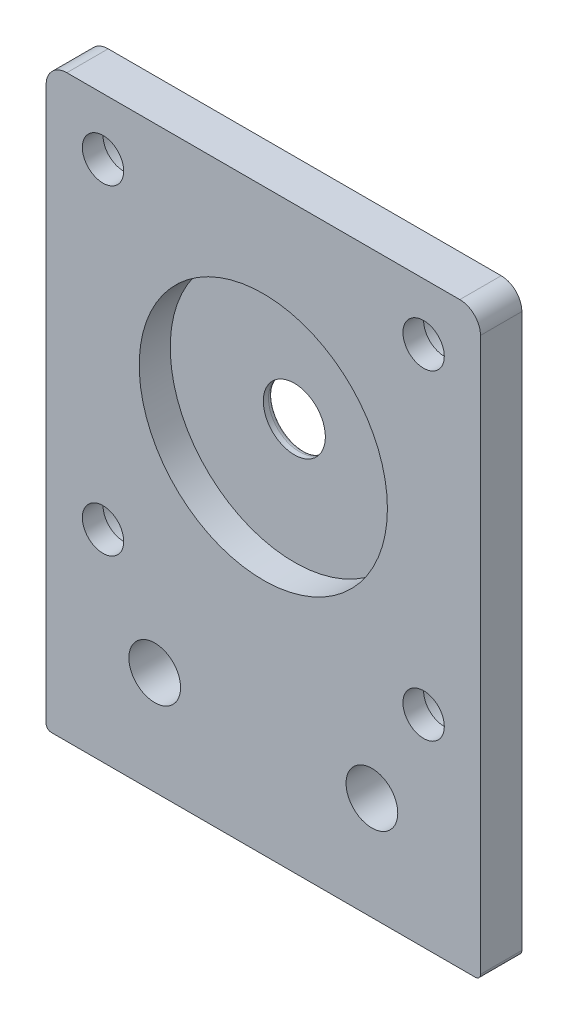
ISO-10303-21;
HEADER;
FILE_DESCRIPTION(('STEP AP214'),'2;1');
FILE_NAME('part.step','',(''),(''),'','','');
FILE_SCHEMA(('AUTOMOTIVE_DESIGN { 1 0 10303 214 1 1 1 1 }'));
ENDSEC;
DATA;
#1=APPLICATION_CONTEXT('core data for automotive mechanical design processes');
#2=APPLICATION_PROTOCOL_DEFINITION('international standard','automotive_design',2000,#1);
#3=PRODUCT_CONTEXT('',#1,'mechanical');
#4=PRODUCT('Part','Part','',(#3));
#5=PRODUCT_RELATED_PRODUCT_CATEGORY('part','',(#4));
#6=PRODUCT_DEFINITION_FORMATION('','',#4);
#7=PRODUCT_DEFINITION_CONTEXT('part definition',#1,'design');
#8=PRODUCT_DEFINITION('design','',#6,#7);
#9=PRODUCT_DEFINITION_SHAPE('','',#8);
#10=(LENGTH_UNIT() NAMED_UNIT(*) SI_UNIT(.MILLI.,.METRE.));
#11=(NAMED_UNIT(*) PLANE_ANGLE_UNIT() SI_UNIT($,.RADIAN.));
#12=(NAMED_UNIT(*) SI_UNIT($,.STERADIAN.) SOLID_ANGLE_UNIT());
#13=UNCERTAINTY_MEASURE_WITH_UNIT(LENGTH_MEASURE(1.E-05),#10,'distance_accuracy_value','');
#14=(GEOMETRIC_REPRESENTATION_CONTEXT(3) GLOBAL_UNCERTAINTY_ASSIGNED_CONTEXT((#13)) GLOBAL_UNIT_ASSIGNED_CONTEXT((#10,
#11,#12)) REPRESENTATION_CONTEXT('',''));
#15=CARTESIAN_POINT('',(0.,0.,0.));
#16=DIRECTION('',(0.,0.,1.));
#17=DIRECTION('',(1.,0.,0.));
#18=AXIS2_PLACEMENT_3D('',#15,#16,#17);
#19=CARTESIAN_POINT('',(5.49999999999594,50.4999999999987,-6.));
#20=DIRECTION('',(0.,0.,1.));
#21=DIRECTION('',(1.,0.,0.));
#22=AXIS2_PLACEMENT_3D('',#19,#20,#21);
#23=CYLINDRICAL_SURFACE('',#22,2.);
#24=CARTESIAN_POINT('',(5.49999999999594,50.4999999999987,4.));
#25=DIRECTION('',(0.,0.,1.));
#26=DIRECTION('',(1.,0.,0.));
#27=AXIS2_PLACEMENT_3D('',#24,#25,#26);
#28=CIRCLE('',#27,2.);
#29=CARTESIAN_POINT('',(7.49999999999594,50.4999999999987,4.));
#30=VERTEX_POINT('',#29);
#31=EDGE_CURVE('E240',#30,#30,#28,.T.);
#32=ORIENTED_EDGE('',*,*,#31,.T.);
#33=EDGE_LOOP('',(#32));
#34=FACE_BOUND('',#33,.T.);
#35=CARTESIAN_POINT('',(5.49999999999594,50.4999999999987,2.));
#36=DIRECTION('',(0.,0.,-1.));
#37=DIRECTION('',(-1.,0.,0.));
#38=AXIS2_PLACEMENT_3D('',#35,#36,#37);
#39=CIRCLE('',#38,2.);
#40=CARTESIAN_POINT('',(3.49999999999594,50.4999999999987,2.));
#41=VERTEX_POINT('',#40);
#42=EDGE_CURVE('E44',#41,#41,#39,.F.);
#43=ORIENTED_EDGE('',*,*,#42,.F.);
#44=EDGE_LOOP('',(#43));
#45=FACE_BOUND('',#44,.T.);
#46=ADVANCED_FACE('F40',(#34,#45),#23,.F.);
#47=CARTESIAN_POINT('',(5.49999999999595,19.4999999999987,-6.));
#48=DIRECTION('',(0.,0.,1.));
#49=DIRECTION('',(1.,0.,0.));
#50=AXIS2_PLACEMENT_3D('',#47,#48,#49);
#51=CYLINDRICAL_SURFACE('',#50,2.);
#52=CARTESIAN_POINT('',(5.49999999999595,19.4999999999987,4.));
#53=DIRECTION('',(0.,0.,1.));
#54=DIRECTION('',(1.,0.,0.));
#55=AXIS2_PLACEMENT_3D('',#52,#53,#54);
#56=CIRCLE('',#55,2.);
#57=CARTESIAN_POINT('',(7.49999999999595,19.4999999999987,4.));
#58=VERTEX_POINT('',#57);
#59=EDGE_CURVE('E236',#58,#58,#56,.T.);
#60=ORIENTED_EDGE('',*,*,#59,.T.);
#61=EDGE_LOOP('',(#60));
#62=FACE_BOUND('',#61,.T.);
#63=CARTESIAN_POINT('',(5.49999999999595,19.4999999999987,2.));
#64=DIRECTION('',(0.,0.,-1.));
#65=DIRECTION('',(-1.,0.,0.));
#66=AXIS2_PLACEMENT_3D('',#63,#64,#65);
#67=CIRCLE('',#66,2.);
#68=CARTESIAN_POINT('',(3.49999999999594,19.4999999999987,2.));
#69=VERTEX_POINT('',#68);
#70=EDGE_CURVE('E218',#69,#69,#67,.F.);
#71=ORIENTED_EDGE('',*,*,#70,.F.);
#72=EDGE_LOOP('',(#71));
#73=FACE_BOUND('',#72,.T.);
#74=ADVANCED_FACE('F295',(#62,#73),#51,.F.);
#75=CARTESIAN_POINT('',(36.4999999999959,19.4999999999987,-6.));
#76=DIRECTION('',(0.,0.,1.));
#77=DIRECTION('',(1.,0.,0.));
#78=AXIS2_PLACEMENT_3D('',#75,#76,#77);
#79=CYLINDRICAL_SURFACE('',#78,2.);
#80=CARTESIAN_POINT('',(36.4999999999959,19.4999999999987,4.));
#81=DIRECTION('',(0.,0.,1.));
#82=DIRECTION('',(1.,0.,0.));
#83=AXIS2_PLACEMENT_3D('',#80,#81,#82);
#84=CIRCLE('',#83,2.);
#85=CARTESIAN_POINT('',(38.4999999999959,19.4999999999987,4.));
#86=VERTEX_POINT('',#85);
#87=EDGE_CURVE('E230',#86,#86,#84,.T.);
#88=ORIENTED_EDGE('',*,*,#87,.T.);
#89=EDGE_LOOP('',(#88));
#90=FACE_BOUND('',#89,.T.);
#91=CARTESIAN_POINT('',(36.4999999999959,19.4999999999987,2.));
#92=DIRECTION('',(0.,0.,-1.));
#93=DIRECTION('',(-1.,0.,0.));
#94=AXIS2_PLACEMENT_3D('',#91,#92,#93);
#95=CIRCLE('',#94,2.);
#96=CARTESIAN_POINT('',(34.4999999999959,19.4999999999987,2.));
#97=VERTEX_POINT('',#96);
#98=EDGE_CURVE('E214',#97,#97,#95,.F.);
#99=ORIENTED_EDGE('',*,*,#98,.F.);
#100=EDGE_LOOP('',(#99));
#101=FACE_BOUND('',#100,.T.);
#102=ADVANCED_FACE('F302',(#90,#101),#79,.F.);
#103=CARTESIAN_POINT('',(36.4999999999959,50.4999999999987,-6.));
#104=DIRECTION('',(0.,0.,1.));
#105=DIRECTION('',(1.,0.,0.));
#106=AXIS2_PLACEMENT_3D('',#103,#104,#105);
#107=CYLINDRICAL_SURFACE('',#106,2.);
#108=CARTESIAN_POINT('',(36.4999999999959,50.4999999999987,4.));
#109=DIRECTION('',(0.,0.,1.));
#110=DIRECTION('',(1.,0.,0.));
#111=AXIS2_PLACEMENT_3D('',#108,#109,#110);
#112=CIRCLE('',#111,2.);
#113=CARTESIAN_POINT('',(38.4999999999959,50.4999999999987,4.));
#114=VERTEX_POINT('',#113);
#115=EDGE_CURVE('E225',#114,#114,#112,.T.);
#116=ORIENTED_EDGE('',*,*,#115,.T.);
#117=EDGE_LOOP('',(#116));
#118=FACE_BOUND('',#117,.T.);
#119=CARTESIAN_POINT('',(36.4999999999959,50.4999999999987,2.));
#120=DIRECTION('',(0.,0.,-1.));
#121=DIRECTION('',(-1.,0.,0.));
#122=AXIS2_PLACEMENT_3D('',#119,#120,#121);
#123=CIRCLE('',#122,2.);
#124=CARTESIAN_POINT('',(34.4999999999959,50.4999999999987,2.));
#125=VERTEX_POINT('',#124);
#126=EDGE_CURVE('E210',#125,#125,#123,.F.);
#127=ORIENTED_EDGE('',*,*,#126,.F.);
#128=EDGE_LOOP('',(#127));
#129=FACE_BOUND('',#128,.T.);
#130=ADVANCED_FACE('F308',(#118,#129),#107,.F.);
#131=CARTESIAN_POINT('',(20.9999999999959,34.9999999999987,4.));
#132=DIRECTION('',(0.,0.,-1.));
#133=DIRECTION('',(-1.,0.,0.));
#134=AXIS2_PLACEMENT_3D('',#131,#132,#133);
#135=CYLINDRICAL_SURFACE('',#134,2.99999999937829);
#136=CARTESIAN_POINT('',(20.9999999999959,34.9999999999987,0.5));
#137=DIRECTION('',(0.,0.,1.));
#138=DIRECTION('',(1.,0.,0.));
#139=AXIS2_PLACEMENT_3D('',#136,#137,#138);
#140=CIRCLE('',#139,2.99999999937829);
#141=CARTESIAN_POINT('',(23.9999999993742,34.9999999999987,0.5));
#142=VERTEX_POINT('',#141);
#143=EDGE_CURVE('E11',#142,#142,#140,.F.);
#144=ORIENTED_EDGE('',*,*,#143,.T.);
#145=EDGE_LOOP('',(#144));
#146=FACE_BOUND('',#145,.T.);
#147=CARTESIAN_POINT('',(20.9999999999959,34.9999999999987,1.));
#148=DIRECTION('',(0.,0.,1.));
#149=DIRECTION('',(1.,0.,0.));
#150=AXIS2_PLACEMENT_3D('',#147,#148,#149);
#151=CIRCLE('',#150,2.99999999937829);
#152=CARTESIAN_POINT('',(23.9999999993742,34.9999999999987,1.));
#153=VERTEX_POINT('',#152);
#154=EDGE_CURVE('E151',#153,#153,#151,.T.);
#155=ORIENTED_EDGE('',*,*,#154,.T.);
#156=EDGE_LOOP('',(#155));
#157=FACE_BOUND('',#156,.T.);
#158=ADVANCED_FACE('F326',(#146,#157),#135,.F.);
#159=CARTESIAN_POINT('',(0.,0.,4.));
#160=DIRECTION('',(0.,0.,1.));
#161=DIRECTION('',(1.,0.,0.));
#162=AXIS2_PLACEMENT_3D('',#159,#160,#161);
#163=PLANE('',#162);
#164=ORIENTED_EDGE('',*,*,#115,.F.);
#165=EDGE_LOOP('',(#164));
#166=FACE_BOUND('',#165,.T.);
#167=ORIENTED_EDGE('',*,*,#87,.F.);
#168=EDGE_LOOP('',(#167));
#169=FACE_BOUND('',#168,.T.);
#170=ORIENTED_EDGE('',*,*,#59,.F.);
#171=EDGE_LOOP('',(#170));
#172=FACE_BOUND('',#171,.T.);
#173=ORIENTED_EDGE('',*,*,#31,.F.);
#174=EDGE_LOOP('',(#173));
#175=FACE_BOUND('',#174,.T.);
#176=CARTESIAN_POINT('',(10.5000000000015,10.,4.));
#177=DIRECTION('',(0.,0.,1.));
#178=DIRECTION('',(1.,0.,0.));
#179=AXIS2_PLACEMENT_3D('',#176,#177,#178);
#180=CIRCLE('',#179,2.5);
#181=CARTESIAN_POINT('',(13.0000000000015,10.,4.));
#182=VERTEX_POINT('',#181);
#183=EDGE_CURVE('E205',#182,#182,#180,.T.);
#184=ORIENTED_EDGE('',*,*,#183,.F.);
#185=EDGE_LOOP('',(#184));
#186=FACE_BOUND('',#185,.T.);
#187=CARTESIAN_POINT('',(31.5000000000016,10.,4.));
#188=DIRECTION('',(0.,0.,1.));
#189=DIRECTION('',(1.,0.,0.));
#190=AXIS2_PLACEMENT_3D('',#187,#188,#189);
#191=CIRCLE('',#190,2.5);
#192=CARTESIAN_POINT('',(34.0000000000016,10.,4.));
#193=VERTEX_POINT('',#192);
#194=EDGE_CURVE('E244',#193,#193,#191,.T.);
#195=ORIENTED_EDGE('',*,*,#194,.F.);
#196=EDGE_LOOP('',(#195));
#197=FACE_BOUND('',#196,.T.);
#198=CARTESIAN_POINT('',(20.9999999999959,34.9999999999987,4.));
#199=DIRECTION('',(0.,0.,1.));
#200=DIRECTION('',(1.,0.,0.));
#201=AXIS2_PLACEMENT_3D('',#198,#199,#200);
#202=CIRCLE('',#201,12.);
#203=CARTESIAN_POINT('',(32.9999999999959,34.9999999999987,4.));
#204=VERTEX_POINT('',#203);
#205=EDGE_CURVE('E209',#204,#204,#202,.T.);
#206=ORIENTED_EDGE('',*,*,#205,.F.);
#207=EDGE_LOOP('',(#206));
#208=FACE_BOUND('',#207,.T.);
#209=DIRECTION('',(1.,0.,0.));
#210=VECTOR('',#209,1.);
#211=CARTESIAN_POINT('',(0.,0.,4.));
#212=LINE('',#211,#210);
#213=CARTESIAN_POINT('',(0.500000000000019,0.,4.));
#214=VERTEX_POINT('',#213);
#215=CARTESIAN_POINT('',(41.5000000000021,0.,4.));
#216=VERTEX_POINT('',#215);
#217=EDGE_CURVE('E145',#214,#216,#212,.T.);
#218=ORIENTED_EDGE('',*,*,#217,.T.);
#219=CARTESIAN_POINT('',(41.5000000000021,0.5,4.));
#220=DIRECTION('',(0.,0.,1.));
#221=DIRECTION('',(1.,0.,0.));
#222=AXIS2_PLACEMENT_3D('',#219,#220,#221);
#223=CIRCLE('',#222,0.5);
#224=CARTESIAN_POINT('',(42.0000000000021,0.5,4.));
#225=VERTEX_POINT('',#224);
#226=EDGE_CURVE('E192',#216,#225,#223,.T.);
#227=ORIENTED_EDGE('',*,*,#226,.T.);
#228=DIRECTION('',(0.,1.,0.));
#229=VECTOR('',#228,1.);
#230=CARTESIAN_POINT('',(42.0000000000021,0.,4.));
#231=LINE('',#230,#229);
#232=CARTESIAN_POINT('',(42.0000000000021,54.0000000000021,4.));
#233=VERTEX_POINT('',#232);
#234=EDGE_CURVE('E259',#225,#233,#231,.T.);
#235=ORIENTED_EDGE('',*,*,#234,.T.);
#236=CARTESIAN_POINT('',(40.0000000000021,54.0000000000021,4.));
#237=DIRECTION('',(0.,0.,1.));
#238=DIRECTION('',(1.,0.,0.));
#239=AXIS2_PLACEMENT_3D('',#236,#237,#238);
#240=CIRCLE('',#239,2.);
#241=CARTESIAN_POINT('',(40.0000000000021,56.0000000000021,4.));
#242=VERTEX_POINT('',#241);
#243=EDGE_CURVE('E166',#233,#242,#240,.T.);
#244=ORIENTED_EDGE('',*,*,#243,.T.);
#245=DIRECTION('',(-1.,0.,0.));
#246=VECTOR('',#245,1.);
#247=CARTESIAN_POINT('',(37.3715728752559,56.0000000000021,4.));
#248=LINE('',#247,#246);
#249=CARTESIAN_POINT('',(2.00000000000201,56.0000000000021,4.));
#250=VERTEX_POINT('',#249);
#251=EDGE_CURVE('E133',#242,#250,#248,.T.);
#252=ORIENTED_EDGE('',*,*,#251,.T.);
#253=CARTESIAN_POINT('',(2.00000000000201,54.0000000000021,4.));
#254=DIRECTION('',(0.,0.,1.));
#255=DIRECTION('',(1.,0.,0.));
#256=AXIS2_PLACEMENT_3D('',#253,#254,#255);
#257=CIRCLE('',#256,2.);
#258=CARTESIAN_POINT('',(2.0073228793446E-12,54.0000000000022,4.));
#259=VERTEX_POINT('',#258);
#260=EDGE_CURVE('E163',#250,#259,#257,.T.);
#261=ORIENTED_EDGE('',*,*,#260,.T.);
#262=DIRECTION('',(0.,-1.,0.));
#263=VECTOR('',#262,1.);
#264=CARTESIAN_POINT('',(0.,0.,4.));
#265=LINE('',#264,#263);
#266=CARTESIAN_POINT('',(0.,0.500000000000018,4.));
#267=VERTEX_POINT('',#266);
#268=EDGE_CURVE('E140',#259,#267,#265,.T.);
#269=ORIENTED_EDGE('',*,*,#268,.T.);
#270=CARTESIAN_POINT('',(0.500000000000019,0.5,4.));
#271=DIRECTION('',(0.,0.,1.));
#272=DIRECTION('',(1.,0.,0.));
#273=AXIS2_PLACEMENT_3D('',#270,#271,#272);
#274=CIRCLE('',#273,0.5);
#275=EDGE_CURVE('E189',#267,#214,#274,.T.);
#276=ORIENTED_EDGE('',*,*,#275,.T.);
#277=EDGE_LOOP('',(#218,#227,#235,#244,#252,#261,#269,#276));
#278=FACE_BOUND('',#277,.T.);
#279=ADVANCED_FACE('F275',(#166,#169,#172,#175,#186,#197,#208,#278),#163,.T.);
#280=CARTESIAN_POINT('',(0.,0.,0.));
#281=DIRECTION('',(0.,0.,1.));
#282=DIRECTION('',(1.,0.,0.));
#283=AXIS2_PLACEMENT_3D('',#280,#281,#282);
#284=PLANE('',#283);
#285=CARTESIAN_POINT('',(5.49999999999594,50.4999999999987,0.));
#286=DIRECTION('',(0.,0.,-1.));
#287=DIRECTION('',(-1.,0.,0.));
#288=AXIS2_PLACEMENT_3D('',#285,#286,#287);
#289=CIRCLE('',#288,3.5);
#290=CARTESIAN_POINT('',(1.99999999999594,50.4999999999987,0.));
#291=VERTEX_POINT('',#290);
#292=EDGE_CURVE('E575',#291,#291,#289,.T.);
#293=ORIENTED_EDGE('',*,*,#292,.F.);
#294=EDGE_LOOP('',(#293));
#295=FACE_BOUND('',#294,.T.);
#296=CARTESIAN_POINT('',(5.49999999999595,19.4999999999987,0.));
#297=DIRECTION('',(0.,0.,-1.));
#298=DIRECTION('',(-1.,0.,0.));
#299=AXIS2_PLACEMENT_3D('',#296,#297,#298);
#300=CIRCLE('',#299,3.5);
#301=CARTESIAN_POINT('',(1.99999999999595,19.4999999999987,0.));
#302=VERTEX_POINT('',#301);
#303=EDGE_CURVE('E583',#302,#302,#300,.T.);
#304=ORIENTED_EDGE('',*,*,#303,.F.);
#305=EDGE_LOOP('',(#304));
#306=FACE_BOUND('',#305,.T.);
#307=CARTESIAN_POINT('',(36.4999999999959,19.4999999999987,0.));
#308=DIRECTION('',(0.,0.,-1.));
#309=DIRECTION('',(-1.,0.,0.));
#310=AXIS2_PLACEMENT_3D('',#307,#308,#309);
#311=CIRCLE('',#310,3.5);
#312=CARTESIAN_POINT('',(32.9999999999959,19.4999999999987,0.));
#313=VERTEX_POINT('',#312);
#314=EDGE_CURVE('E591',#313,#313,#311,.T.);
#315=ORIENTED_EDGE('',*,*,#314,.F.);
#316=EDGE_LOOP('',(#315));
#317=FACE_BOUND('',#316,.T.);
#318=CARTESIAN_POINT('',(36.4999999999959,50.4999999999987,0.));
#319=DIRECTION('',(0.,0.,-1.));
#320=DIRECTION('',(-1.,0.,0.));
#321=AXIS2_PLACEMENT_3D('',#318,#319,#320);
#322=CIRCLE('',#321,3.5);
#323=CARTESIAN_POINT('',(32.9999999999959,50.4999999999987,0.));
#324=VERTEX_POINT('',#323);
#325=EDGE_CURVE('E567',#324,#324,#322,.T.);
#326=ORIENTED_EDGE('',*,*,#325,.F.);
#327=EDGE_LOOP('',(#326));
#328=FACE_BOUND('',#327,.T.);
#329=CARTESIAN_POINT('',(10.5000000000015,10.,0.));
#330=DIRECTION('',(0.,0.,1.));
#331=DIRECTION('',(1.,0.,0.));
#332=AXIS2_PLACEMENT_3D('',#329,#330,#331);
#333=CIRCLE('',#332,2.5);
#334=CARTESIAN_POINT('',(13.0000000000015,10.,0.));
#335=VERTEX_POINT('',#334);
#336=EDGE_CURVE('E204',#335,#335,#333,.T.);
#337=ORIENTED_EDGE('',*,*,#336,.T.);
#338=EDGE_LOOP('',(#337));
#339=FACE_BOUND('',#338,.T.);
#340=CARTESIAN_POINT('',(31.5000000000016,10.,0.));
#341=DIRECTION('',(0.,0.,1.));
#342=DIRECTION('',(1.,0.,0.));
#343=AXIS2_PLACEMENT_3D('',#340,#341,#342);
#344=CIRCLE('',#343,2.5);
#345=CARTESIAN_POINT('',(34.0000000000016,10.,0.));
#346=VERTEX_POINT('',#345);
#347=EDGE_CURVE('E200',#346,#346,#344,.T.);
#348=ORIENTED_EDGE('',*,*,#347,.T.);
#349=EDGE_LOOP('',(#348));
#350=FACE_BOUND('',#349,.T.);
#351=CARTESIAN_POINT('',(20.9999999999959,34.9999999999987,0.));
#352=DIRECTION('',(0.,0.,1.));
#353=DIRECTION('',(1.,0.,0.));
#354=AXIS2_PLACEMENT_3D('',#351,#352,#353);
#355=CIRCLE('',#354,3.49999999937829);
#356=CARTESIAN_POINT('',(24.4999999993742,34.9999999999987,0.));
#357=VERTEX_POINT('',#356);
#358=EDGE_CURVE('E50',#357,#357,#355,.T.);
#359=ORIENTED_EDGE('',*,*,#358,.T.);
#360=EDGE_LOOP('',(#359));
#361=FACE_BOUND('',#360,.T.);
#362=DIRECTION('',(0.,1.,0.));
#363=VECTOR('',#362,1.);
#364=CARTESIAN_POINT('',(42.0000000000021,56.0000000000021,0.));
#365=LINE('',#364,#363);
#366=CARTESIAN_POINT('',(42.0000000000021,0.5,0.));
#367=VERTEX_POINT('',#366);
#368=CARTESIAN_POINT('',(42.0000000000021,54.0000000000021,0.));
#369=VERTEX_POINT('',#368);
#370=EDGE_CURVE('E141',#367,#369,#365,.T.);
#371=ORIENTED_EDGE('',*,*,#370,.F.);
#372=CARTESIAN_POINT('',(41.5000000000021,0.5,0.));
#373=DIRECTION('',(0.,0.,1.));
#374=DIRECTION('',(1.,0.,0.));
#375=AXIS2_PLACEMENT_3D('',#372,#373,#374);
#376=CIRCLE('',#375,0.5);
#377=CARTESIAN_POINT('',(41.5000000000021,0.,0.));
#378=VERTEX_POINT('',#377);
#379=EDGE_CURVE('E180',#367,#378,#376,.F.);
#380=ORIENTED_EDGE('',*,*,#379,.T.);
#381=DIRECTION('',(1.,0.,0.));
#382=VECTOR('',#381,1.);
#383=CARTESIAN_POINT('',(0.,0.,0.));
#384=LINE('',#383,#382);
#385=CARTESIAN_POINT('',(0.500000000000019,0.,0.));
#386=VERTEX_POINT('',#385);
#387=EDGE_CURVE('E147',#386,#378,#384,.T.);
#388=ORIENTED_EDGE('',*,*,#387,.F.);
#389=CARTESIAN_POINT('',(0.500000000000019,0.5,0.));
#390=DIRECTION('',(0.,0.,1.));
#391=DIRECTION('',(1.,0.,0.));
#392=AXIS2_PLACEMENT_3D('',#389,#390,#391);
#393=CIRCLE('',#392,0.5);
#394=CARTESIAN_POINT('',(0.,0.500000000000018,0.));
#395=VERTEX_POINT('',#394);
#396=EDGE_CURVE('E177',#386,#395,#393,.F.);
#397=ORIENTED_EDGE('',*,*,#396,.T.);
#398=DIRECTION('',(0.,-1.,0.));
#399=VECTOR('',#398,1.);
#400=CARTESIAN_POINT('',(0.,0.,0.));
#401=LINE('',#400,#399);
#402=CARTESIAN_POINT('',(2.0073228793446E-12,54.0000000000022,0.));
#403=VERTEX_POINT('',#402);
#404=EDGE_CURVE('E155',#403,#395,#401,.T.);
#405=ORIENTED_EDGE('',*,*,#404,.F.);
#406=CARTESIAN_POINT('',(2.00000000000201,54.0000000000021,0.));
#407=DIRECTION('',(0.,0.,1.));
#408=DIRECTION('',(1.,0.,0.));
#409=AXIS2_PLACEMENT_3D('',#406,#407,#408);
#410=CIRCLE('',#409,2.);
#411=CARTESIAN_POINT('',(2.00000000000201,56.0000000000021,0.));
#412=VERTEX_POINT('',#411);
#413=EDGE_CURVE('E124',#403,#412,#410,.F.);
#414=ORIENTED_EDGE('',*,*,#413,.T.);
#415=DIRECTION('',(-1.,0.,0.));
#416=VECTOR('',#415,1.);
#417=CARTESIAN_POINT('',(4.6284271247483,56.0000000000021,0.));
#418=LINE('',#417,#416);
#419=CARTESIAN_POINT('',(40.0000000000021,56.0000000000021,0.));
#420=VERTEX_POINT('',#419);
#421=EDGE_CURVE('E130',#420,#412,#418,.T.);
#422=ORIENTED_EDGE('',*,*,#421,.F.);
#423=CARTESIAN_POINT('',(40.0000000000021,54.0000000000021,0.));
#424=DIRECTION('',(0.,0.,1.));
#425=DIRECTION('',(1.,0.,0.));
#426=AXIS2_PLACEMENT_3D('',#423,#424,#425);
#427=CIRCLE('',#426,2.);
#428=EDGE_CURVE('E113',#420,#369,#427,.F.);
#429=ORIENTED_EDGE('',*,*,#428,.T.);
#430=EDGE_LOOP('',(#371,#380,#388,#397,#405,#414,#422,#429));
#431=FACE_BOUND('',#430,.T.);
#432=ADVANCED_FACE('F137',(#295,#306,#317,#328,#339,#350,#361,#431),#284,.F.);
#433=CARTESIAN_POINT('',(0.,0.,4.));
#434=DIRECTION('',(1.,0.,0.));
#435=DIRECTION('',(0.,1.,0.));
#436=AXIS2_PLACEMENT_3D('',#433,#434,#435);
#437=PLANE('',#436);
#438=ORIENTED_EDGE('',*,*,#404,.T.);
#439=DIRECTION('',(0.,0.,-1.));
#440=VECTOR('',#439,1.);
#441=CARTESIAN_POINT('',(0.,0.500000000000019,4.));
#442=LINE('',#441,#440);
#443=EDGE_CURVE('E58',#395,#267,#442,.F.);
#444=ORIENTED_EDGE('',*,*,#443,.T.);
#445=ORIENTED_EDGE('',*,*,#268,.F.);
#446=DIRECTION('',(0.,0.,-1.));
#447=VECTOR('',#446,1.);
#448=CARTESIAN_POINT('',(2.0073228793446E-12,54.0000000000022,4.));
#449=LINE('',#448,#447);
#450=EDGE_CURVE('E169',#259,#403,#449,.T.);
#451=ORIENTED_EDGE('',*,*,#450,.T.);
#452=EDGE_LOOP('',(#438,#444,#445,#451));
#453=FACE_BOUND('',#452,.T.);
#454=ADVANCED_FACE('F282',(#453),#437,.F.);
#455=CARTESIAN_POINT('',(0.,0.,4.));
#456=DIRECTION('',(0.,1.,0.));
#457=DIRECTION('',(0.,0.,1.));
#458=AXIS2_PLACEMENT_3D('',#455,#456,#457);
#459=PLANE('',#458);
#460=ORIENTED_EDGE('',*,*,#387,.T.);
#461=DIRECTION('',(0.,0.,-1.));
#462=VECTOR('',#461,1.);
#463=CARTESIAN_POINT('',(41.5000000000021,0.,4.));
#464=LINE('',#463,#462);
#465=EDGE_CURVE('E66',#378,#216,#464,.F.);
#466=ORIENTED_EDGE('',*,*,#465,.T.);
#467=ORIENTED_EDGE('',*,*,#217,.F.);
#468=DIRECTION('',(0.,0.,-1.));
#469=VECTOR('',#468,1.);
#470=CARTESIAN_POINT('',(0.500000000000019,0.,4.));
#471=LINE('',#470,#469);
#472=EDGE_CURVE('E183',#214,#386,#471,.T.);
#473=ORIENTED_EDGE('',*,*,#472,.T.);
#474=EDGE_LOOP('',(#460,#466,#467,#473));
#475=FACE_BOUND('',#474,.T.);
#476=ADVANCED_FACE('F267',(#475),#459,.F.);
#477=CARTESIAN_POINT('',(42.0000000000021,56.0000000000021,4.));
#478=DIRECTION('',(-1.,0.,0.));
#479=DIRECTION('',(0.,0.,1.));
#480=AXIS2_PLACEMENT_3D('',#477,#478,#479);
#481=PLANE('',#480);
#482=ORIENTED_EDGE('',*,*,#234,.F.);
#483=DIRECTION('',(0.,0.,-1.));
#484=VECTOR('',#483,1.);
#485=CARTESIAN_POINT('',(42.0000000000021,0.5,4.));
#486=LINE('',#485,#484);
#487=EDGE_CURVE('E173',#225,#367,#486,.T.);
#488=ORIENTED_EDGE('',*,*,#487,.T.);
#489=ORIENTED_EDGE('',*,*,#370,.T.);
#490=DIRECTION('',(0.,0.,-1.));
#491=VECTOR('',#490,1.);
#492=CARTESIAN_POINT('',(42.0000000000021,54.0000000000021,4.));
#493=LINE('',#492,#491);
#494=EDGE_CURVE('E119',#369,#233,#493,.F.);
#495=ORIENTED_EDGE('',*,*,#494,.T.);
#496=EDGE_LOOP('',(#482,#488,#489,#495));
#497=FACE_BOUND('',#496,.T.);
#498=ADVANCED_FACE('F277',(#497),#481,.F.);
#499=CARTESIAN_POINT('',(4.6284271247483,56.0000000000021,4.));
#500=DIRECTION('',(0.,-1.,0.));
#501=DIRECTION('',(0.,0.,-1.));
#502=AXIS2_PLACEMENT_3D('',#499,#500,#501);
#503=PLANE('',#502);
#504=ORIENTED_EDGE('',*,*,#251,.F.);
#505=DIRECTION('',(0.,0.,-1.));
#506=VECTOR('',#505,1.);
#507=CARTESIAN_POINT('',(40.0000000000021,56.0000000000021,4.));
#508=LINE('',#507,#506);
#509=EDGE_CURVE('E117',#242,#420,#508,.T.);
#510=ORIENTED_EDGE('',*,*,#509,.T.);
#511=ORIENTED_EDGE('',*,*,#421,.T.);
#512=DIRECTION('',(0.,0.,-1.));
#513=VECTOR('',#512,1.);
#514=CARTESIAN_POINT('',(2.00000000000201,56.0000000000021,4.));
#515=LINE('',#514,#513);
#516=EDGE_CURVE('E135',#412,#250,#515,.F.);
#517=ORIENTED_EDGE('',*,*,#516,.T.);
#518=EDGE_LOOP('',(#504,#510,#511,#517));
#519=FACE_BOUND('',#518,.T.);
#520=ADVANCED_FACE('F129',(#519),#503,.F.);
#521=CARTESIAN_POINT('',(20.9999999999959,34.9999999999987,1.));
#522=DIRECTION('',(0.,0.,1.));
#523=DIRECTION('',(1.,0.,0.));
#524=AXIS2_PLACEMENT_3D('',#521,#522,#523);
#525=CYLINDRICAL_SURFACE('',#524,12.);
#526=CARTESIAN_POINT('',(20.9999999999959,34.9999999999987,1.));
#527=DIRECTION('',(0.,0.,1.));
#528=DIRECTION('',(1.,0.,0.));
#529=AXIS2_PLACEMENT_3D('',#526,#527,#528);
#530=CIRCLE('',#529,12.);
#531=CARTESIAN_POINT('',(32.9999999999959,34.9999999999987,1.));
#532=VERTEX_POINT('',#531);
#533=EDGE_CURVE('E156',#532,#532,#530,.T.);
#534=ORIENTED_EDGE('',*,*,#533,.F.);
#535=EDGE_LOOP('',(#534));
#536=FACE_BOUND('',#535,.T.);
#537=ORIENTED_EDGE('',*,*,#205,.T.);
#538=EDGE_LOOP('',(#537));
#539=FACE_BOUND('',#538,.T.);
#540=ADVANCED_FACE('F321',(#536,#539),#525,.F.);
#541=CARTESIAN_POINT('',(20.9999999999959,34.9999999999987,1.));
#542=DIRECTION('',(0.,0.,1.));
#543=DIRECTION('',(1.,0.,0.));
#544=AXIS2_PLACEMENT_3D('',#541,#542,#543);
#545=PLANE('',#544);
#546=ORIENTED_EDGE('',*,*,#154,.F.);
#547=EDGE_LOOP('',(#546));
#548=FACE_BOUND('',#547,.T.);
#549=ORIENTED_EDGE('',*,*,#533,.T.);
#550=EDGE_LOOP('',(#549));
#551=FACE_BOUND('',#550,.T.);
#552=ADVANCED_FACE('F318',(#548,#551),#545,.T.);
#553=CARTESIAN_POINT('',(40.0000000000021,54.0000000000021,4.));
#554=DIRECTION('',(0.,0.,-1.));
#555=DIRECTION('',(-1.,0.,0.));
#556=AXIS2_PLACEMENT_3D('',#553,#554,#555);
#557=CYLINDRICAL_SURFACE('',#556,2.);
#558=ORIENTED_EDGE('',*,*,#243,.F.);
#559=ORIENTED_EDGE('',*,*,#494,.F.);
#560=ORIENTED_EDGE('',*,*,#428,.F.);
#561=ORIENTED_EDGE('',*,*,#509,.F.);
#562=EDGE_LOOP('',(#558,#559,#560,#561));
#563=FACE_BOUND('',#562,.T.);
#564=ADVANCED_FACE('F116',(#563),#557,.T.);
#565=CARTESIAN_POINT('',(2.00000000000201,54.0000000000021,4.));
#566=DIRECTION('',(0.,0.,-1.));
#567=DIRECTION('',(-1.,0.,0.));
#568=AXIS2_PLACEMENT_3D('',#565,#566,#567);
#569=CYLINDRICAL_SURFACE('',#568,2.);
#570=ORIENTED_EDGE('',*,*,#260,.F.);
#571=ORIENTED_EDGE('',*,*,#516,.F.);
#572=ORIENTED_EDGE('',*,*,#413,.F.);
#573=ORIENTED_EDGE('',*,*,#450,.F.);
#574=EDGE_LOOP('',(#570,#571,#572,#573));
#575=FACE_BOUND('',#574,.T.);
#576=ADVANCED_FACE('F281',(#575),#569,.T.);
#577=CARTESIAN_POINT('',(41.5000000000021,0.5,4.));
#578=DIRECTION('',(0.,0.,-1.));
#579=DIRECTION('',(-1.,0.,0.));
#580=AXIS2_PLACEMENT_3D('',#577,#578,#579);
#581=CYLINDRICAL_SURFACE('',#580,0.5);
#582=ORIENTED_EDGE('',*,*,#226,.F.);
#583=ORIENTED_EDGE('',*,*,#465,.F.);
#584=ORIENTED_EDGE('',*,*,#379,.F.);
#585=ORIENTED_EDGE('',*,*,#487,.F.);
#586=EDGE_LOOP('',(#582,#583,#584,#585));
#587=FACE_BOUND('',#586,.T.);
#588=ADVANCED_FACE('F271',(#587),#581,.T.);
#589=CARTESIAN_POINT('',(0.500000000000019,0.5,4.));
#590=DIRECTION('',(0.,0.,-1.));
#591=DIRECTION('',(-1.,0.,0.));
#592=AXIS2_PLACEMENT_3D('',#589,#590,#591);
#593=CYLINDRICAL_SURFACE('',#592,0.5);
#594=ORIENTED_EDGE('',*,*,#275,.F.);
#595=ORIENTED_EDGE('',*,*,#443,.F.);
#596=ORIENTED_EDGE('',*,*,#396,.F.);
#597=ORIENTED_EDGE('',*,*,#472,.F.);
#598=EDGE_LOOP('',(#594,#595,#596,#597));
#599=FACE_BOUND('',#598,.T.);
#600=ADVANCED_FACE('F285',(#599),#593,.T.);
#601=CARTESIAN_POINT('',(20.9999999999959,34.9999999999987,0.5));
#602=DIRECTION('',(0.,0.,1.));
#603=DIRECTION('',(1.,0.,0.));
#604=AXIS2_PLACEMENT_3D('',#601,#602,#603);
#605=TOROIDAL_SURFACE('',#604,3.49999999937829,0.5);
#606=ORIENTED_EDGE('',*,*,#143,.F.);
#607=EDGE_LOOP('',(#606));
#608=FACE_BOUND('',#607,.T.);
#609=ORIENTED_EDGE('',*,*,#358,.F.);
#610=EDGE_LOOP('',(#609));
#611=FACE_BOUND('',#610,.T.);
#612=ADVANCED_FACE('F42',(#608,#611),#605,.T.);
#613=CARTESIAN_POINT('',(31.5000000000016,10.,-6.));
#614=DIRECTION('',(0.,0.,1.));
#615=DIRECTION('',(1.,0.,0.));
#616=AXIS2_PLACEMENT_3D('',#613,#614,#615);
#617=CYLINDRICAL_SURFACE('',#616,2.5);
#618=ORIENTED_EDGE('',*,*,#194,.T.);
#619=EDGE_LOOP('',(#618));
#620=FACE_BOUND('',#619,.T.);
#621=ORIENTED_EDGE('',*,*,#347,.F.);
#622=EDGE_LOOP('',(#621));
#623=FACE_BOUND('',#622,.T.);
#624=ADVANCED_FACE('F291',(#620,#623),#617,.F.);
#625=CARTESIAN_POINT('',(10.5000000000015,10.,-6.));
#626=DIRECTION('',(0.,0.,1.));
#627=DIRECTION('',(1.,0.,0.));
#628=AXIS2_PLACEMENT_3D('',#625,#626,#627);
#629=CYLINDRICAL_SURFACE('',#628,2.5);
#630=ORIENTED_EDGE('',*,*,#183,.T.);
#631=EDGE_LOOP('',(#630));
#632=FACE_BOUND('',#631,.T.);
#633=ORIENTED_EDGE('',*,*,#336,.F.);
#634=EDGE_LOOP('',(#633));
#635=FACE_BOUND('',#634,.T.);
#636=ADVANCED_FACE('F310',(#632,#635),#629,.F.);
#637=CARTESIAN_POINT('',(36.4999999999959,50.4999999999987,2.));
#638=DIRECTION('',(0.,0.,-1.));
#639=DIRECTION('',(-1.,0.,0.));
#640=AXIS2_PLACEMENT_3D('',#637,#638,#639);
#641=PLANE('',#640);
#642=CARTESIAN_POINT('',(36.4999999999959,50.4999999999987,2.));
#643=DIRECTION('',(0.,0.,-1.));
#644=DIRECTION('',(-1.,0.,0.));
#645=AXIS2_PLACEMENT_3D('',#642,#643,#644);
#646=CIRCLE('',#645,3.5);
#647=CARTESIAN_POINT('',(32.9999999999959,50.4999999999987,2.));
#648=VERTEX_POINT('',#647);
#649=EDGE_CURVE('E215',#648,#648,#646,.T.);
#650=ORIENTED_EDGE('',*,*,#649,.T.);
#651=EDGE_LOOP('',(#650));
#652=FACE_BOUND('',#651,.T.);
#653=ORIENTED_EDGE('',*,*,#126,.T.);
#654=EDGE_LOOP('',(#653));
#655=FACE_BOUND('',#654,.T.);
#656=ADVANCED_FACE('F313',(#652,#655),#641,.T.);
#657=CARTESIAN_POINT('',(36.4999999999959,50.4999999999987,2.));
#658=DIRECTION('',(0.,0.,-1.));
#659=DIRECTION('',(-1.,0.,0.));
#660=AXIS2_PLACEMENT_3D('',#657,#658,#659);
#661=CYLINDRICAL_SURFACE('',#660,3.5);
#662=ORIENTED_EDGE('',*,*,#649,.F.);
#663=EDGE_LOOP('',(#662));
#664=FACE_BOUND('',#663,.T.);
#665=ORIENTED_EDGE('',*,*,#325,.T.);
#666=EDGE_LOOP('',(#665));
#667=FACE_BOUND('',#666,.T.);
#668=ADVANCED_FACE('F459',(#664,#667),#661,.F.);
#669=CARTESIAN_POINT('',(36.4999999999959,19.4999999999987,2.));
#670=DIRECTION('',(0.,0.,-1.));
#671=DIRECTION('',(-1.,0.,0.));
#672=AXIS2_PLACEMENT_3D('',#669,#670,#671);
#673=PLANE('',#672);
#674=CARTESIAN_POINT('',(36.4999999999959,19.4999999999987,2.));
#675=DIRECTION('',(0.,0.,-1.));
#676=DIRECTION('',(-1.,0.,0.));
#677=AXIS2_PLACEMENT_3D('',#674,#675,#676);
#678=CIRCLE('',#677,3.5);
#679=CARTESIAN_POINT('',(32.9999999999959,19.4999999999987,2.));
#680=VERTEX_POINT('',#679);
#681=EDGE_CURVE('E571',#680,#680,#678,.T.);
#682=ORIENTED_EDGE('',*,*,#681,.T.);
#683=EDGE_LOOP('',(#682));
#684=FACE_BOUND('',#683,.T.);
#685=ORIENTED_EDGE('',*,*,#98,.T.);
#686=EDGE_LOOP('',(#685));
#687=FACE_BOUND('',#686,.T.);
#688=ADVANCED_FACE('F470',(#684,#687),#673,.T.);
#689=CARTESIAN_POINT('',(36.4999999999959,19.4999999999987,2.));
#690=DIRECTION('',(0.,0.,-1.));
#691=DIRECTION('',(-1.,0.,0.));
#692=AXIS2_PLACEMENT_3D('',#689,#690,#691);
#693=CYLINDRICAL_SURFACE('',#692,3.5);
#694=ORIENTED_EDGE('',*,*,#681,.F.);
#695=EDGE_LOOP('',(#694));
#696=FACE_BOUND('',#695,.T.);
#697=ORIENTED_EDGE('',*,*,#314,.T.);
#698=EDGE_LOOP('',(#697));
#699=FACE_BOUND('',#698,.T.);
#700=ADVANCED_FACE('F480',(#696,#699),#693,.F.);
#701=CARTESIAN_POINT('',(5.49999999999595,19.4999999999987,2.));
#702=DIRECTION('',(0.,0.,-1.));
#703=DIRECTION('',(-1.,0.,0.));
#704=AXIS2_PLACEMENT_3D('',#701,#702,#703);
#705=PLANE('',#704);
#706=CARTESIAN_POINT('',(5.49999999999595,19.4999999999987,2.));
#707=DIRECTION('',(0.,0.,-1.));
#708=DIRECTION('',(-1.,0.,0.));
#709=AXIS2_PLACEMENT_3D('',#706,#707,#708);
#710=CIRCLE('',#709,3.5);
#711=CARTESIAN_POINT('',(1.99999999999595,19.4999999999987,2.));
#712=VERTEX_POINT('',#711);
#713=EDGE_CURVE('E587',#712,#712,#710,.T.);
#714=ORIENTED_EDGE('',*,*,#713,.T.);
#715=EDGE_LOOP('',(#714));
#716=FACE_BOUND('',#715,.T.);
#717=ORIENTED_EDGE('',*,*,#70,.T.);
#718=EDGE_LOOP('',(#717));
#719=FACE_BOUND('',#718,.T.);
#720=ADVANCED_FACE('F490',(#716,#719),#705,.T.);
#721=CARTESIAN_POINT('',(5.49999999999595,19.4999999999987,2.));
#722=DIRECTION('',(0.,0.,-1.));
#723=DIRECTION('',(-1.,0.,0.));
#724=AXIS2_PLACEMENT_3D('',#721,#722,#723);
#725=CYLINDRICAL_SURFACE('',#724,3.5);
#726=ORIENTED_EDGE('',*,*,#713,.F.);
#727=EDGE_LOOP('',(#726));
#728=FACE_BOUND('',#727,.T.);
#729=ORIENTED_EDGE('',*,*,#303,.T.);
#730=EDGE_LOOP('',(#729));
#731=FACE_BOUND('',#730,.T.);
#732=ADVANCED_FACE('F500',(#728,#731),#725,.F.);
#733=CARTESIAN_POINT('',(5.49999999999594,50.4999999999987,2.));
#734=DIRECTION('',(0.,0.,-1.));
#735=DIRECTION('',(-1.,0.,0.));
#736=AXIS2_PLACEMENT_3D('',#733,#734,#735);
#737=PLANE('',#736);
#738=CARTESIAN_POINT('',(5.49999999999594,50.4999999999987,2.));
#739=DIRECTION('',(0.,0.,-1.));
#740=DIRECTION('',(-1.,0.,0.));
#741=AXIS2_PLACEMENT_3D('',#738,#739,#740);
#742=CIRCLE('',#741,3.5);
#743=CARTESIAN_POINT('',(1.99999999999594,50.4999999999987,2.));
#744=VERTEX_POINT('',#743);
#745=EDGE_CURVE('E579',#744,#744,#742,.T.);
#746=ORIENTED_EDGE('',*,*,#745,.T.);
#747=EDGE_LOOP('',(#746));
#748=FACE_BOUND('',#747,.T.);
#749=ORIENTED_EDGE('',*,*,#42,.T.);
#750=EDGE_LOOP('',(#749));
#751=FACE_BOUND('',#750,.T.);
#752=ADVANCED_FACE('F510',(#748,#751),#737,.T.);
#753=CARTESIAN_POINT('',(5.49999999999594,50.4999999999987,2.));
#754=DIRECTION('',(0.,0.,-1.));
#755=DIRECTION('',(-1.,0.,0.));
#756=AXIS2_PLACEMENT_3D('',#753,#754,#755);
#757=CYLINDRICAL_SURFACE('',#756,3.5);
#758=ORIENTED_EDGE('',*,*,#745,.F.);
#759=EDGE_LOOP('',(#758));
#760=FACE_BOUND('',#759,.T.);
#761=ORIENTED_EDGE('',*,*,#292,.T.);
#762=EDGE_LOOP('',(#761));
#763=FACE_BOUND('',#762,.T.);
#764=ADVANCED_FACE('F520',(#760,#763),#757,.F.);
#765=CLOSED_SHELL('',(#46,#74,#102,#130,#158,#279,#432,#454,#476,#498,#520,#540,#552,#564,#576,
#588,#600,#612,#624,#636,#656,#668,#688,#700,#720,#732,#752,#764));
#766=MANIFOLD_SOLID_BREP('B2',#765);
#767=ADVANCED_BREP_SHAPE_REPRESENTATION('',(#18,#766),#14);
#768=SHAPE_DEFINITION_REPRESENTATION(#9,#767);
ENDSEC;
END-ISO-10303-21;
